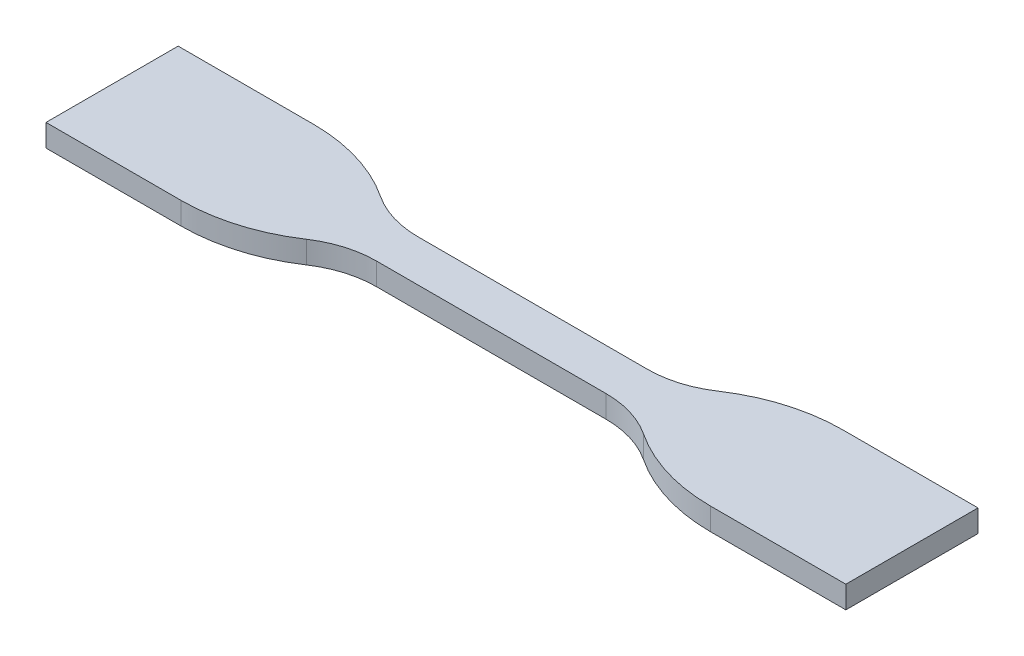
ISO-10303-21;
HEADER;
FILE_DESCRIPTION(('STEP AP214'),'2;1');
FILE_NAME('part.step','',(''),(''),'','','');
FILE_SCHEMA(('AUTOMOTIVE_DESIGN { 1 0 10303 214 1 1 1 1 }'));
ENDSEC;
DATA;
#1=APPLICATION_CONTEXT('core data for automotive mechanical design processes');
#2=APPLICATION_PROTOCOL_DEFINITION('international standard','automotive_design',2000,#1);
#3=PRODUCT_CONTEXT('',#1,'mechanical');
#4=PRODUCT('Part','Part','',(#3));
#5=PRODUCT_RELATED_PRODUCT_CATEGORY('part','',(#4));
#6=PRODUCT_DEFINITION_FORMATION('','',#4);
#7=PRODUCT_DEFINITION_CONTEXT('part definition',#1,'design');
#8=PRODUCT_DEFINITION('design','',#6,#7);
#9=PRODUCT_DEFINITION_SHAPE('','',#8);
#10=(LENGTH_UNIT() NAMED_UNIT(*) SI_UNIT(.MILLI.,.METRE.));
#11=(NAMED_UNIT(*) PLANE_ANGLE_UNIT() SI_UNIT($,.RADIAN.));
#12=(NAMED_UNIT(*) SI_UNIT($,.STERADIAN.) SOLID_ANGLE_UNIT());
#13=UNCERTAINTY_MEASURE_WITH_UNIT(LENGTH_MEASURE(1.E-05),#10,'distance_accuracy_value','');
#14=(GEOMETRIC_REPRESENTATION_CONTEXT(3) GLOBAL_UNCERTAINTY_ASSIGNED_CONTEXT((#13)) GLOBAL_UNIT_ASSIGNED_CONTEXT((#10,
#11,#12)) REPRESENTATION_CONTEXT('',''));
#15=CARTESIAN_POINT('',(0.,0.,0.));
#16=DIRECTION('',(0.,0.,1.));
#17=DIRECTION('',(1.,0.,0.));
#18=AXIS2_PLACEMENT_3D('',#15,#16,#17);
#19=CARTESIAN_POINT('',(-16.5,3.2,-17.));
#20=DIRECTION('',(0.,-1.,0.));
#21=DIRECTION('',(0.,0.,-1.));
#22=AXIS2_PLACEMENT_3D('',#19,#20,#21);
#23=CYLINDRICAL_SURFACE('',#22,14.);
#24=CARTESIAN_POINT('',(-16.5,0.,-17.));
#25=DIRECTION('',(0.,-1.,0.));
#26=DIRECTION('',(0.,0.,-1.));
#27=AXIS2_PLACEMENT_3D('',#24,#25,#26);
#28=CIRCLE('',#27,14.);
#29=CARTESIAN_POINT('',(-16.5,0.,-3.));
#30=VERTEX_POINT('',#29);
#31=CARTESIAN_POINT('',(-24.2387911774959,0.,-5.33333333333333));
#32=VERTEX_POINT('',#31);
#33=EDGE_CURVE('E177',#30,#32,#28,.T.);
#34=ORIENTED_EDGE('',*,*,#33,.T.);
#35=DIRECTION('',(0.,-1.,0.));
#36=VECTOR('',#35,1.);
#37=CARTESIAN_POINT('',(-24.2387911774959,3.2,-5.33333333333333));
#38=LINE('',#37,#36);
#39=CARTESIAN_POINT('',(-24.2387911774959,3.2,-5.33333333333333));
#40=VERTEX_POINT('',#39);
#41=EDGE_CURVE('E11',#40,#32,#38,.T.);
#42=ORIENTED_EDGE('',*,*,#41,.F.);
#43=CARTESIAN_POINT('',(-16.5,3.2,-17.));
#44=DIRECTION('',(0.,-1.,0.));
#45=DIRECTION('',(0.,0.,-1.));
#46=AXIS2_PLACEMENT_3D('',#43,#44,#45);
#47=CIRCLE('',#46,14.);
#48=CARTESIAN_POINT('',(-16.5,3.2,-3.));
#49=VERTEX_POINT('',#48);
#50=EDGE_CURVE('E207',#49,#40,#47,.T.);
#51=ORIENTED_EDGE('',*,*,#50,.F.);
#52=DIRECTION('',(0.,-1.,0.));
#53=VECTOR('',#52,1.);
#54=CARTESIAN_POINT('',(-16.5,3.2,-3.));
#55=LINE('',#54,#53);
#56=EDGE_CURVE('E173',#49,#30,#55,.T.);
#57=ORIENTED_EDGE('',*,*,#56,.T.);
#58=EDGE_LOOP('',(#34,#42,#51,#57));
#59=FACE_BOUND('',#58,.T.);
#60=ADVANCED_FACE('F33',(#59),#23,.F.);
#61=CARTESIAN_POINT('',(-38.0580611373101,3.2,15.5));
#62=DIRECTION('',(0.,-1.,0.));
#63=DIRECTION('',(0.,0.,-1.));
#64=AXIS2_PLACEMENT_3D('',#61,#62,#63);
#65=CYLINDRICAL_SURFACE('',#64,25.);
#66=CARTESIAN_POINT('',(-38.0580611373101,0.,15.5));
#67=DIRECTION('',(0.,1.,0.));
#68=DIRECTION('',(0.,0.,-1.));
#69=AXIS2_PLACEMENT_3D('',#66,#67,#68);
#70=CIRCLE('',#69,25.);
#71=CARTESIAN_POINT('',(-38.0580611373101,0.,-9.5));
#72=VERTEX_POINT('',#71);
#73=EDGE_CURVE('E180',#32,#72,#70,.T.);
#74=ORIENTED_EDGE('',*,*,#73,.T.);
#75=DIRECTION('',(0.,-1.,0.));
#76=VECTOR('',#75,1.);
#77=CARTESIAN_POINT('',(-38.0580611373101,3.2,-9.5));
#78=LINE('',#77,#76);
#79=CARTESIAN_POINT('',(-38.0580611373101,3.2,-9.5));
#80=VERTEX_POINT('',#79);
#81=EDGE_CURVE('E41',#80,#72,#78,.T.);
#82=ORIENTED_EDGE('',*,*,#81,.F.);
#83=CARTESIAN_POINT('',(-38.0580611373101,3.2,15.5));
#84=DIRECTION('',(0.,1.,0.));
#85=DIRECTION('',(0.,0.,-1.));
#86=AXIS2_PLACEMENT_3D('',#83,#84,#85);
#87=CIRCLE('',#86,25.);
#88=EDGE_CURVE('E116',#40,#80,#87,.T.);
#89=ORIENTED_EDGE('',*,*,#88,.F.);
#90=ORIENTED_EDGE('',*,*,#41,.T.);
#91=EDGE_LOOP('',(#74,#82,#89,#90));
#92=FACE_BOUND('',#91,.T.);
#93=ADVANCED_FACE('F305',(#92),#65,.T.);
#94=CARTESIAN_POINT('',(-38.0580611373101,3.2,-9.5));
#95=DIRECTION('',(0.,0.,1.));
#96=DIRECTION('',(1.,0.,0.));
#97=AXIS2_PLACEMENT_3D('',#94,#95,#96);
#98=PLANE('',#97);
#99=DIRECTION('',(-1.,0.,0.));
#100=VECTOR('',#99,1.);
#101=CARTESIAN_POINT('',(-38.0580611373101,0.,-9.5));
#102=LINE('',#101,#100);
#103=CARTESIAN_POINT('',(-57.5,0.,-9.50000000000001));
#104=VERTEX_POINT('',#103);
#105=EDGE_CURVE('E182',#72,#104,#102,.T.);
#106=ORIENTED_EDGE('',*,*,#105,.T.);
#107=DIRECTION('',(0.,-1.,0.));
#108=VECTOR('',#107,1.);
#109=CARTESIAN_POINT('',(-57.5,3.2,-9.50000000000001));
#110=LINE('',#109,#108);
#111=CARTESIAN_POINT('',(-57.5,3.2,-9.50000000000001));
#112=VERTEX_POINT('',#111);
#113=EDGE_CURVE('E238',#112,#104,#110,.T.);
#114=ORIENTED_EDGE('',*,*,#113,.F.);
#115=DIRECTION('',(-1.,0.,0.));
#116=VECTOR('',#115,1.);
#117=CARTESIAN_POINT('',(-38.0580611373101,3.2,-9.5));
#118=LINE('',#117,#116);
#119=EDGE_CURVE('E246',#80,#112,#118,.T.);
#120=ORIENTED_EDGE('',*,*,#119,.F.);
#121=ORIENTED_EDGE('',*,*,#81,.T.);
#122=EDGE_LOOP('',(#106,#114,#120,#121));
#123=FACE_BOUND('',#122,.T.);
#124=ADVANCED_FACE('F244',(#123),#98,.F.);
#125=CARTESIAN_POINT('',(-57.5,3.2,-9.50000000000001));
#126=DIRECTION('',(1.,0.,0.));
#127=DIRECTION('',(0.,0.,-1.));
#128=AXIS2_PLACEMENT_3D('',#125,#126,#127);
#129=PLANE('',#128);
#130=DIRECTION('',(0.,0.,1.));
#131=VECTOR('',#130,1.);
#132=CARTESIAN_POINT('',(-57.5,0.,-9.50000000000001));
#133=LINE('',#132,#131);
#134=CARTESIAN_POINT('',(-57.5,0.,9.49999999999999));
#135=VERTEX_POINT('',#134);
#136=EDGE_CURVE('E184',#104,#135,#133,.T.);
#137=ORIENTED_EDGE('',*,*,#136,.T.);
#138=DIRECTION('',(0.,-1.,0.));
#139=VECTOR('',#138,1.);
#140=CARTESIAN_POINT('',(-57.5,3.2,9.49999999999999));
#141=LINE('',#140,#139);
#142=CARTESIAN_POINT('',(-57.5,3.2,9.49999999999999));
#143=VERTEX_POINT('',#142);
#144=EDGE_CURVE('E235',#143,#135,#141,.T.);
#145=ORIENTED_EDGE('',*,*,#144,.F.);
#146=DIRECTION('',(0.,0.,1.));
#147=VECTOR('',#146,1.);
#148=CARTESIAN_POINT('',(-57.5,3.2,-9.50000000000001));
#149=LINE('',#148,#147);
#150=EDGE_CURVE('E264',#112,#143,#149,.T.);
#151=ORIENTED_EDGE('',*,*,#150,.F.);
#152=ORIENTED_EDGE('',*,*,#113,.T.);
#153=EDGE_LOOP('',(#137,#145,#151,#152));
#154=FACE_BOUND('',#153,.T.);
#155=ADVANCED_FACE('F255',(#154),#129,.F.);
#156=CARTESIAN_POINT('',(-57.5,3.2,9.49999999999999));
#157=DIRECTION('',(0.,0.,-1.));
#158=DIRECTION('',(-1.,0.,0.));
#159=AXIS2_PLACEMENT_3D('',#156,#157,#158);
#160=PLANE('',#159);
#161=DIRECTION('',(1.,0.,0.));
#162=VECTOR('',#161,1.);
#163=CARTESIAN_POINT('',(-57.5,0.,9.49999999999999));
#164=LINE('',#163,#162);
#165=CARTESIAN_POINT('',(-38.0580611373101,0.,9.5));
#166=VERTEX_POINT('',#165);
#167=EDGE_CURVE('E186',#135,#166,#164,.T.);
#168=ORIENTED_EDGE('',*,*,#167,.T.);
#169=DIRECTION('',(0.,-1.,0.));
#170=VECTOR('',#169,1.);
#171=CARTESIAN_POINT('',(-38.0580611373101,3.2,9.5));
#172=LINE('',#171,#170);
#173=CARTESIAN_POINT('',(-38.0580611373101,3.2,9.5));
#174=VERTEX_POINT('',#173);
#175=EDGE_CURVE('E232',#174,#166,#172,.T.);
#176=ORIENTED_EDGE('',*,*,#175,.F.);
#177=DIRECTION('',(1.,0.,0.));
#178=VECTOR('',#177,1.);
#179=CARTESIAN_POINT('',(-57.5,3.2,9.49999999999999));
#180=LINE('',#179,#178);
#181=EDGE_CURVE('E261',#143,#174,#180,.T.);
#182=ORIENTED_EDGE('',*,*,#181,.F.);
#183=ORIENTED_EDGE('',*,*,#144,.T.);
#184=EDGE_LOOP('',(#168,#176,#182,#183));
#185=FACE_BOUND('',#184,.T.);
#186=ADVANCED_FACE('F259',(#185),#160,.F.);
#187=CARTESIAN_POINT('',(-38.0580611373101,3.2,-15.5));
#188=DIRECTION('',(0.,-1.,0.));
#189=DIRECTION('',(0.,0.,-1.));
#190=AXIS2_PLACEMENT_3D('',#187,#188,#189);
#191=CYLINDRICAL_SURFACE('',#190,25.);
#192=CARTESIAN_POINT('',(-38.0580611373101,0.,-15.5));
#193=DIRECTION('',(0.,1.,0.));
#194=DIRECTION('',(0.,0.,1.));
#195=AXIS2_PLACEMENT_3D('',#192,#193,#194);
#196=CIRCLE('',#195,25.);
#197=CARTESIAN_POINT('',(-24.2387911774959,0.,5.33333333333333));
#198=VERTEX_POINT('',#197);
#199=EDGE_CURVE('E188',#166,#198,#196,.T.);
#200=ORIENTED_EDGE('',*,*,#199,.T.);
#201=DIRECTION('',(0.,-1.,0.));
#202=VECTOR('',#201,1.);
#203=CARTESIAN_POINT('',(-24.2387911774959,3.2,5.33333333333333));
#204=LINE('',#203,#202);
#205=CARTESIAN_POINT('',(-24.2387911774959,3.2,5.33333333333333));
#206=VERTEX_POINT('',#205);
#207=EDGE_CURVE('E229',#206,#198,#204,.T.);
#208=ORIENTED_EDGE('',*,*,#207,.F.);
#209=CARTESIAN_POINT('',(-38.0580611373101,3.2,-15.5));
#210=DIRECTION('',(0.,1.,0.));
#211=DIRECTION('',(0.,0.,1.));
#212=AXIS2_PLACEMENT_3D('',#209,#210,#211);
#213=CIRCLE('',#212,25.);
#214=EDGE_CURVE('E263',#174,#206,#213,.T.);
#215=ORIENTED_EDGE('',*,*,#214,.F.);
#216=ORIENTED_EDGE('',*,*,#175,.T.);
#217=EDGE_LOOP('',(#200,#208,#215,#216));
#218=FACE_BOUND('',#217,.T.);
#219=ADVANCED_FACE('F318',(#218),#191,.T.);
#220=CARTESIAN_POINT('',(-16.5,3.2,17.));
#221=DIRECTION('',(0.,-1.,0.));
#222=DIRECTION('',(0.,0.,-1.));
#223=AXIS2_PLACEMENT_3D('',#220,#221,#222);
#224=CYLINDRICAL_SURFACE('',#223,14.);
#225=CARTESIAN_POINT('',(-16.5,0.,17.));
#226=DIRECTION('',(0.,-1.,0.));
#227=DIRECTION('',(0.,0.,1.));
#228=AXIS2_PLACEMENT_3D('',#225,#226,#227);
#229=CIRCLE('',#228,14.);
#230=CARTESIAN_POINT('',(-16.5,0.,3.));
#231=VERTEX_POINT('',#230);
#232=EDGE_CURVE('E190',#198,#231,#229,.T.);
#233=ORIENTED_EDGE('',*,*,#232,.T.);
#234=DIRECTION('',(0.,-1.,0.));
#235=VECTOR('',#234,1.);
#236=CARTESIAN_POINT('',(-16.5,3.2,3.));
#237=LINE('',#236,#235);
#238=CARTESIAN_POINT('',(-16.5,3.2,3.));
#239=VERTEX_POINT('',#238);
#240=EDGE_CURVE('E226',#239,#231,#237,.T.);
#241=ORIENTED_EDGE('',*,*,#240,.F.);
#242=CARTESIAN_POINT('',(-16.5,3.2,17.));
#243=DIRECTION('',(0.,-1.,0.));
#244=DIRECTION('',(0.,0.,1.));
#245=AXIS2_PLACEMENT_3D('',#242,#243,#244);
#246=CIRCLE('',#245,14.);
#247=EDGE_CURVE('E266',#206,#239,#246,.T.);
#248=ORIENTED_EDGE('',*,*,#247,.F.);
#249=ORIENTED_EDGE('',*,*,#207,.T.);
#250=EDGE_LOOP('',(#233,#241,#248,#249));
#251=FACE_BOUND('',#250,.T.);
#252=ADVANCED_FACE('F321',(#251),#224,.F.);
#253=CARTESIAN_POINT('',(-16.5,3.2,3.));
#254=DIRECTION('',(0.,0.,-1.));
#255=DIRECTION('',(-1.,0.,0.));
#256=AXIS2_PLACEMENT_3D('',#253,#254,#255);
#257=PLANE('',#256);
#258=DIRECTION('',(1.,0.,0.));
#259=VECTOR('',#258,1.);
#260=CARTESIAN_POINT('',(-16.5,0.,3.));
#261=LINE('',#260,#259);
#262=CARTESIAN_POINT('',(16.5,0.,3.));
#263=VERTEX_POINT('',#262);
#264=EDGE_CURVE('E192',#231,#263,#261,.T.);
#265=ORIENTED_EDGE('',*,*,#264,.T.);
#266=DIRECTION('',(0.,-1.,0.));
#267=VECTOR('',#266,1.);
#268=CARTESIAN_POINT('',(16.5,3.2,3.));
#269=LINE('',#268,#267);
#270=CARTESIAN_POINT('',(16.5,3.2,3.));
#271=VERTEX_POINT('',#270);
#272=EDGE_CURVE('E223',#271,#263,#269,.T.);
#273=ORIENTED_EDGE('',*,*,#272,.F.);
#274=DIRECTION('',(1.,0.,0.));
#275=VECTOR('',#274,1.);
#276=CARTESIAN_POINT('',(-16.5,3.2,3.));
#277=LINE('',#276,#275);
#278=EDGE_CURVE('E272',#239,#271,#277,.T.);
#279=ORIENTED_EDGE('',*,*,#278,.F.);
#280=ORIENTED_EDGE('',*,*,#240,.T.);
#281=EDGE_LOOP('',(#265,#273,#279,#280));
#282=FACE_BOUND('',#281,.T.);
#283=ADVANCED_FACE('F325',(#282),#257,.F.);
#284=CARTESIAN_POINT('',(16.5,3.2,17.));
#285=DIRECTION('',(0.,-1.,0.));
#286=DIRECTION('',(0.,0.,-1.));
#287=AXIS2_PLACEMENT_3D('',#284,#285,#286);
#288=CYLINDRICAL_SURFACE('',#287,14.);
#289=CARTESIAN_POINT('',(16.5,0.,17.));
#290=DIRECTION('',(0.,-1.,0.));
#291=DIRECTION('',(0.,0.,-1.));
#292=AXIS2_PLACEMENT_3D('',#289,#290,#291);
#293=CIRCLE('',#292,14.);
#294=CARTESIAN_POINT('',(24.2387911774959,0.,5.33333333333334));
#295=VERTEX_POINT('',#294);
#296=EDGE_CURVE('E194',#263,#295,#293,.T.);
#297=ORIENTED_EDGE('',*,*,#296,.T.);
#298=DIRECTION('',(0.,-1.,0.));
#299=VECTOR('',#298,1.);
#300=CARTESIAN_POINT('',(24.2387911774959,3.2,5.33333333333334));
#301=LINE('',#300,#299);
#302=CARTESIAN_POINT('',(24.2387911774959,3.2,5.33333333333334));
#303=VERTEX_POINT('',#302);
#304=EDGE_CURVE('E220',#303,#295,#301,.T.);
#305=ORIENTED_EDGE('',*,*,#304,.F.);
#306=CARTESIAN_POINT('',(16.5,3.2,17.));
#307=DIRECTION('',(0.,-1.,0.));
#308=DIRECTION('',(0.,0.,-1.));
#309=AXIS2_PLACEMENT_3D('',#306,#307,#308);
#310=CIRCLE('',#309,14.);
#311=EDGE_CURVE('E274',#271,#303,#310,.T.);
#312=ORIENTED_EDGE('',*,*,#311,.F.);
#313=ORIENTED_EDGE('',*,*,#272,.T.);
#314=EDGE_LOOP('',(#297,#305,#312,#313));
#315=FACE_BOUND('',#314,.T.);
#316=ADVANCED_FACE('F329',(#315),#288,.F.);
#317=CARTESIAN_POINT('',(38.0580611373101,3.2,-15.5));
#318=DIRECTION('',(0.,-1.,0.));
#319=DIRECTION('',(0.,0.,-1.));
#320=AXIS2_PLACEMENT_3D('',#317,#318,#319);
#321=CYLINDRICAL_SURFACE('',#320,25.);
#322=CARTESIAN_POINT('',(38.0580611373101,0.,-15.5));
#323=DIRECTION('',(0.,1.,0.));
#324=DIRECTION('',(0.,0.,-1.));
#325=AXIS2_PLACEMENT_3D('',#322,#323,#324);
#326=CIRCLE('',#325,25.);
#327=CARTESIAN_POINT('',(38.0580611373101,0.,9.5));
#328=VERTEX_POINT('',#327);
#329=EDGE_CURVE('E196',#295,#328,#326,.T.);
#330=ORIENTED_EDGE('',*,*,#329,.T.);
#331=DIRECTION('',(0.,-1.,0.));
#332=VECTOR('',#331,1.);
#333=CARTESIAN_POINT('',(38.0580611373101,3.2,9.5));
#334=LINE('',#333,#332);
#335=CARTESIAN_POINT('',(38.0580611373101,3.2,9.5));
#336=VERTEX_POINT('',#335);
#337=EDGE_CURVE('E217',#336,#328,#334,.T.);
#338=ORIENTED_EDGE('',*,*,#337,.F.);
#339=CARTESIAN_POINT('',(38.0580611373101,3.2,-15.5));
#340=DIRECTION('',(0.,1.,0.));
#341=DIRECTION('',(0.,0.,-1.));
#342=AXIS2_PLACEMENT_3D('',#339,#340,#341);
#343=CIRCLE('',#342,25.);
#344=EDGE_CURVE('E276',#303,#336,#343,.T.);
#345=ORIENTED_EDGE('',*,*,#344,.F.);
#346=ORIENTED_EDGE('',*,*,#304,.T.);
#347=EDGE_LOOP('',(#330,#338,#345,#346));
#348=FACE_BOUND('',#347,.T.);
#349=ADVANCED_FACE('F333',(#348),#321,.T.);
#350=CARTESIAN_POINT('',(57.5,3.2,9.49999999999999));
#351=DIRECTION('',(0.,0.,-1.));
#352=DIRECTION('',(-1.,0.,0.));
#353=AXIS2_PLACEMENT_3D('',#350,#351,#352);
#354=PLANE('',#353);
#355=DIRECTION('',(1.,0.,0.));
#356=VECTOR('',#355,1.);
#357=CARTESIAN_POINT('',(57.5,0.,9.49999999999999));
#358=LINE('',#357,#356);
#359=CARTESIAN_POINT('',(57.5,0.,9.49999999999999));
#360=VERTEX_POINT('',#359);
#361=EDGE_CURVE('E198',#328,#360,#358,.T.);
#362=ORIENTED_EDGE('',*,*,#361,.T.);
#363=DIRECTION('',(0.,-1.,0.));
#364=VECTOR('',#363,1.);
#365=CARTESIAN_POINT('',(57.5,3.2,9.49999999999999));
#366=LINE('',#365,#364);
#367=CARTESIAN_POINT('',(57.5,3.2,9.49999999999999));
#368=VERTEX_POINT('',#367);
#369=EDGE_CURVE('E214',#368,#360,#366,.T.);
#370=ORIENTED_EDGE('',*,*,#369,.F.);
#371=DIRECTION('',(1.,0.,0.));
#372=VECTOR('',#371,1.);
#373=CARTESIAN_POINT('',(57.5,3.2,9.49999999999999));
#374=LINE('',#373,#372);
#375=EDGE_CURVE('E278',#336,#368,#374,.T.);
#376=ORIENTED_EDGE('',*,*,#375,.F.);
#377=ORIENTED_EDGE('',*,*,#337,.T.);
#378=EDGE_LOOP('',(#362,#370,#376,#377));
#379=FACE_BOUND('',#378,.T.);
#380=ADVANCED_FACE('F337',(#379),#354,.F.);
#381=CARTESIAN_POINT('',(57.5,3.2,-9.50000000000001));
#382=DIRECTION('',(-1.,0.,0.));
#383=DIRECTION('',(0.,0.,1.));
#384=AXIS2_PLACEMENT_3D('',#381,#382,#383);
#385=PLANE('',#384);
#386=DIRECTION('',(0.,0.,-1.));
#387=VECTOR('',#386,1.);
#388=CARTESIAN_POINT('',(57.5,0.,-9.50000000000001));
#389=LINE('',#388,#387);
#390=CARTESIAN_POINT('',(57.5,0.,-9.50000000000001));
#391=VERTEX_POINT('',#390);
#392=EDGE_CURVE('E200',#360,#391,#389,.T.);
#393=ORIENTED_EDGE('',*,*,#392,.T.);
#394=DIRECTION('',(0.,-1.,0.));
#395=VECTOR('',#394,1.);
#396=CARTESIAN_POINT('',(57.5,3.2,-9.50000000000001));
#397=LINE('',#396,#395);
#398=CARTESIAN_POINT('',(57.5,3.2,-9.50000000000001));
#399=VERTEX_POINT('',#398);
#400=EDGE_CURVE('E211',#399,#391,#397,.T.);
#401=ORIENTED_EDGE('',*,*,#400,.F.);
#402=DIRECTION('',(0.,0.,-1.));
#403=VECTOR('',#402,1.);
#404=CARTESIAN_POINT('',(57.5,3.2,-9.50000000000001));
#405=LINE('',#404,#403);
#406=EDGE_CURVE('E280',#368,#399,#405,.T.);
#407=ORIENTED_EDGE('',*,*,#406,.F.);
#408=ORIENTED_EDGE('',*,*,#369,.T.);
#409=EDGE_LOOP('',(#393,#401,#407,#408));
#410=FACE_BOUND('',#409,.T.);
#411=ADVANCED_FACE('F286',(#410),#385,.F.);
#412=CARTESIAN_POINT('',(38.0580611373101,3.2,-9.5));
#413=DIRECTION('',(0.,0.,1.));
#414=DIRECTION('',(1.,0.,0.));
#415=AXIS2_PLACEMENT_3D('',#412,#413,#414);
#416=PLANE('',#415);
#417=DIRECTION('',(-1.,0.,0.));
#418=VECTOR('',#417,1.);
#419=CARTESIAN_POINT('',(38.0580611373101,0.,-9.5));
#420=LINE('',#419,#418);
#421=CARTESIAN_POINT('',(38.0580611373101,0.,-9.5));
#422=VERTEX_POINT('',#421);
#423=EDGE_CURVE('E202',#391,#422,#420,.T.);
#424=ORIENTED_EDGE('',*,*,#423,.T.);
#425=DIRECTION('',(0.,-1.,0.));
#426=VECTOR('',#425,1.);
#427=CARTESIAN_POINT('',(38.0580611373101,3.2,-9.5));
#428=LINE('',#427,#426);
#429=CARTESIAN_POINT('',(38.0580611373101,3.2,-9.5));
#430=VERTEX_POINT('',#429);
#431=EDGE_CURVE('E168',#430,#422,#428,.T.);
#432=ORIENTED_EDGE('',*,*,#431,.F.);
#433=DIRECTION('',(-1.,0.,0.));
#434=VECTOR('',#433,1.);
#435=CARTESIAN_POINT('',(38.0580611373101,3.2,-9.5));
#436=LINE('',#435,#434);
#437=EDGE_CURVE('E159',#399,#430,#436,.T.);
#438=ORIENTED_EDGE('',*,*,#437,.F.);
#439=ORIENTED_EDGE('',*,*,#400,.T.);
#440=EDGE_LOOP('',(#424,#432,#438,#439));
#441=FACE_BOUND('',#440,.T.);
#442=ADVANCED_FACE('F290',(#441),#416,.F.);
#443=CARTESIAN_POINT('',(38.0580611373101,3.2,15.5));
#444=DIRECTION('',(0.,-1.,0.));
#445=DIRECTION('',(0.,0.,-1.));
#446=AXIS2_PLACEMENT_3D('',#443,#444,#445);
#447=CYLINDRICAL_SURFACE('',#446,25.);
#448=CARTESIAN_POINT('',(38.0580611373101,0.,15.5));
#449=DIRECTION('',(0.,1.,0.));
#450=DIRECTION('',(0.,0.,1.));
#451=AXIS2_PLACEMENT_3D('',#448,#449,#450);
#452=CIRCLE('',#451,25.);
#453=CARTESIAN_POINT('',(24.2387911774959,0.,-5.33333333333333));
#454=VERTEX_POINT('',#453);
#455=EDGE_CURVE('E167',#422,#454,#452,.T.);
#456=ORIENTED_EDGE('',*,*,#455,.T.);
#457=DIRECTION('',(0.,-1.,0.));
#458=VECTOR('',#457,1.);
#459=CARTESIAN_POINT('',(24.2387911774959,3.2,-5.33333333333333));
#460=LINE('',#459,#458);
#461=CARTESIAN_POINT('',(24.2387911774959,3.2,-5.33333333333333));
#462=VERTEX_POINT('',#461);
#463=EDGE_CURVE('E164',#462,#454,#460,.T.);
#464=ORIENTED_EDGE('',*,*,#463,.F.);
#465=CARTESIAN_POINT('',(38.0580611373101,3.2,15.5));
#466=DIRECTION('',(0.,1.,0.));
#467=DIRECTION('',(0.,0.,1.));
#468=AXIS2_PLACEMENT_3D('',#465,#466,#467);
#469=CIRCLE('',#468,25.);
#470=EDGE_CURVE('E153',#430,#462,#469,.T.);
#471=ORIENTED_EDGE('',*,*,#470,.F.);
#472=ORIENTED_EDGE('',*,*,#431,.T.);
#473=EDGE_LOOP('',(#456,#464,#471,#472));
#474=FACE_BOUND('',#473,.T.);
#475=ADVANCED_FACE('F165',(#474),#447,.T.);
#476=CARTESIAN_POINT('',(16.5,3.2,-17.));
#477=DIRECTION('',(0.,-1.,0.));
#478=DIRECTION('',(0.,0.,-1.));
#479=AXIS2_PLACEMENT_3D('',#476,#477,#478);
#480=CYLINDRICAL_SURFACE('',#479,14.);
#481=CARTESIAN_POINT('',(16.5,0.,-17.));
#482=DIRECTION('',(0.,-1.,0.));
#483=DIRECTION('',(0.,0.,1.));
#484=AXIS2_PLACEMENT_3D('',#481,#482,#483);
#485=CIRCLE('',#484,14.);
#486=CARTESIAN_POINT('',(16.5,0.,-3.));
#487=VERTEX_POINT('',#486);
#488=EDGE_CURVE('E102',#454,#487,#485,.T.);
#489=ORIENTED_EDGE('',*,*,#488,.T.);
#490=DIRECTION('',(0.,-1.,0.));
#491=VECTOR('',#490,1.);
#492=CARTESIAN_POINT('',(16.5,3.2,-3.));
#493=LINE('',#492,#491);
#494=CARTESIAN_POINT('',(16.5,3.2,-3.));
#495=VERTEX_POINT('',#494);
#496=EDGE_CURVE('E169',#495,#487,#493,.T.);
#497=ORIENTED_EDGE('',*,*,#496,.F.);
#498=CARTESIAN_POINT('',(16.5,3.2,-17.));
#499=DIRECTION('',(0.,-1.,0.));
#500=DIRECTION('',(0.,0.,1.));
#501=AXIS2_PLACEMENT_3D('',#498,#499,#500);
#502=CIRCLE('',#501,14.);
#503=EDGE_CURVE('E157',#462,#495,#502,.T.);
#504=ORIENTED_EDGE('',*,*,#503,.F.);
#505=ORIENTED_EDGE('',*,*,#463,.T.);
#506=EDGE_LOOP('',(#489,#497,#504,#505));
#507=FACE_BOUND('',#506,.T.);
#508=ADVANCED_FACE('F171',(#507),#480,.F.);
#509=CARTESIAN_POINT('',(-16.5,3.2,-3.));
#510=DIRECTION('',(0.,0.,1.));
#511=DIRECTION('',(1.,0.,0.));
#512=AXIS2_PLACEMENT_3D('',#509,#510,#511);
#513=PLANE('',#512);
#514=DIRECTION('',(-1.,0.,0.));
#515=VECTOR('',#514,1.);
#516=CARTESIAN_POINT('',(-16.5,0.,-3.));
#517=LINE('',#516,#515);
#518=EDGE_CURVE('E108',#487,#30,#517,.T.);
#519=ORIENTED_EDGE('',*,*,#518,.T.);
#520=ORIENTED_EDGE('',*,*,#56,.F.);
#521=DIRECTION('',(-1.,0.,0.));
#522=VECTOR('',#521,1.);
#523=CARTESIAN_POINT('',(-16.5,3.2,-3.));
#524=LINE('',#523,#522);
#525=EDGE_CURVE('E49',#495,#49,#524,.T.);
#526=ORIENTED_EDGE('',*,*,#525,.F.);
#527=ORIENTED_EDGE('',*,*,#496,.T.);
#528=EDGE_LOOP('',(#519,#520,#526,#527));
#529=FACE_BOUND('',#528,.T.);
#530=ADVANCED_FACE('F294',(#529),#513,.F.);
#531=CARTESIAN_POINT('',(-16.5,3.2,-17.));
#532=DIRECTION('',(0.,-1.,0.));
#533=DIRECTION('',(0.,0.,-1.));
#534=AXIS2_PLACEMENT_3D('',#531,#532,#533);
#535=PLANE('',#534);
#536=ORIENTED_EDGE('',*,*,#50,.T.);
#537=ORIENTED_EDGE('',*,*,#88,.T.);
#538=ORIENTED_EDGE('',*,*,#119,.T.);
#539=ORIENTED_EDGE('',*,*,#150,.T.);
#540=ORIENTED_EDGE('',*,*,#181,.T.);
#541=ORIENTED_EDGE('',*,*,#214,.T.);
#542=ORIENTED_EDGE('',*,*,#247,.T.);
#543=ORIENTED_EDGE('',*,*,#278,.T.);
#544=ORIENTED_EDGE('',*,*,#311,.T.);
#545=ORIENTED_EDGE('',*,*,#344,.T.);
#546=ORIENTED_EDGE('',*,*,#375,.T.);
#547=ORIENTED_EDGE('',*,*,#406,.T.);
#548=ORIENTED_EDGE('',*,*,#437,.T.);
#549=ORIENTED_EDGE('',*,*,#470,.T.);
#550=ORIENTED_EDGE('',*,*,#503,.T.);
#551=ORIENTED_EDGE('',*,*,#525,.T.);
#552=EDGE_LOOP('',(#536,#537,#538,#539,#540,#541,#542,#543,#544,#545,#546,#547,#548,#549,#550,#551));
#553=FACE_BOUND('',#552,.T.);
#554=ADVANCED_FACE('F155',(#553),#535,.F.);
#555=CARTESIAN_POINT('',(-16.5,0.,-17.));
#556=DIRECTION('',(0.,-1.,0.));
#557=DIRECTION('',(0.,0.,-1.));
#558=AXIS2_PLACEMENT_3D('',#555,#556,#557);
#559=PLANE('',#558);
#560=ORIENTED_EDGE('',*,*,#33,.F.);
#561=ORIENTED_EDGE('',*,*,#518,.F.);
#562=ORIENTED_EDGE('',*,*,#488,.F.);
#563=ORIENTED_EDGE('',*,*,#455,.F.);
#564=ORIENTED_EDGE('',*,*,#423,.F.);
#565=ORIENTED_EDGE('',*,*,#392,.F.);
#566=ORIENTED_EDGE('',*,*,#361,.F.);
#567=ORIENTED_EDGE('',*,*,#329,.F.);
#568=ORIENTED_EDGE('',*,*,#296,.F.);
#569=ORIENTED_EDGE('',*,*,#264,.F.);
#570=ORIENTED_EDGE('',*,*,#232,.F.);
#571=ORIENTED_EDGE('',*,*,#199,.F.);
#572=ORIENTED_EDGE('',*,*,#167,.F.);
#573=ORIENTED_EDGE('',*,*,#136,.F.);
#574=ORIENTED_EDGE('',*,*,#105,.F.);
#575=ORIENTED_EDGE('',*,*,#73,.F.);
#576=EDGE_LOOP('',(#560,#561,#562,#563,#564,#565,#566,#567,#568,#569,#570,#571,#572,#573,#574,#575));
#577=FACE_BOUND('',#576,.T.);
#578=ADVANCED_FACE('F250',(#577),#559,.T.);
#579=CLOSED_SHELL('',(#60,#93,#124,#155,#186,#219,#252,#283,#316,#349,#380,#411,#442,#475,#508,
#530,#554,#578));
#580=MANIFOLD_SOLID_BREP('B2',#579);
#581=ADVANCED_BREP_SHAPE_REPRESENTATION('',(#18,#580),#14);
#582=SHAPE_DEFINITION_REPRESENTATION(#9,#581);
ENDSEC;
END-ISO-10303-21;
